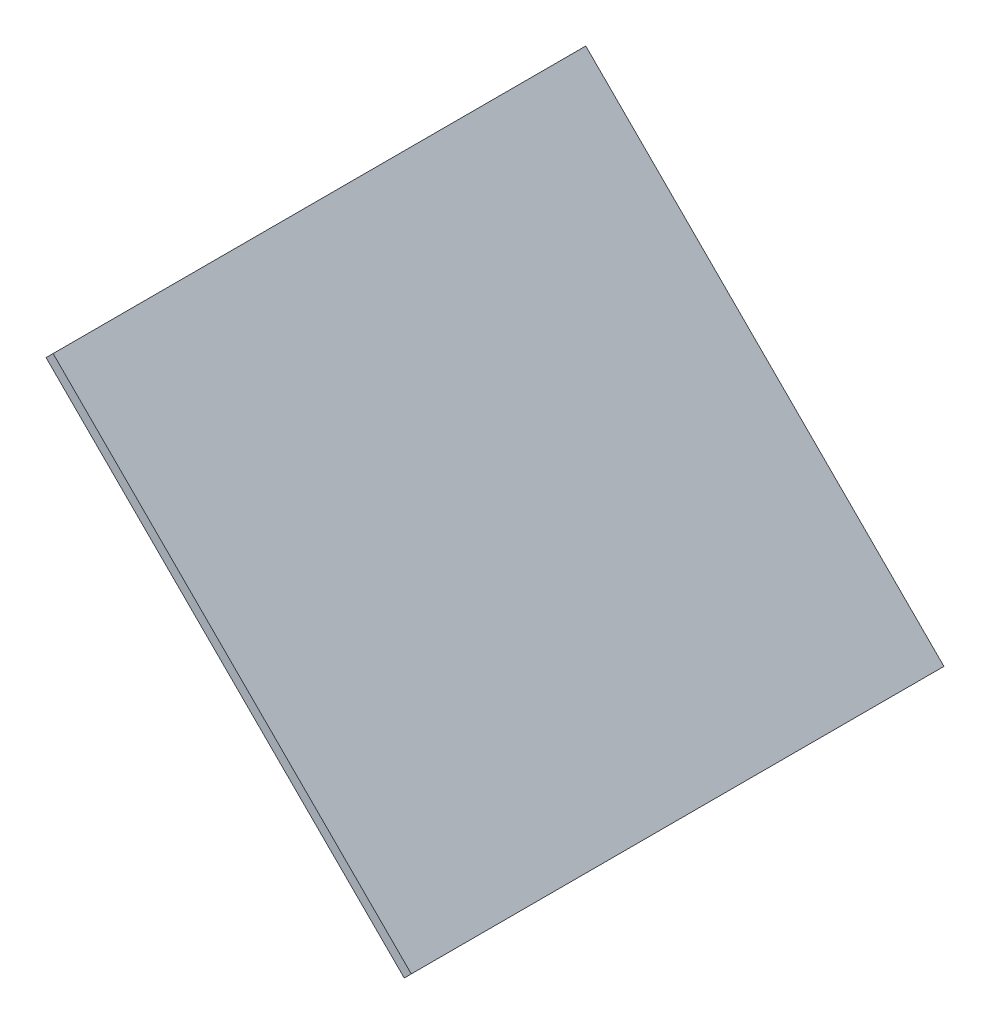
ISO-10303-21;
HEADER;
FILE_DESCRIPTION(('STEP AP214'),'2;1');
FILE_NAME('part.step','',(''),(''),'','','');
FILE_SCHEMA(('AUTOMOTIVE_DESIGN { 1 0 10303 214 1 1 1 1 }'));
ENDSEC;
DATA;
#1=APPLICATION_CONTEXT('core data for automotive mechanical design processes');
#2=APPLICATION_PROTOCOL_DEFINITION('international standard','automotive_design',2000,#1);
#3=PRODUCT_CONTEXT('',#1,'mechanical');
#4=PRODUCT('Part','Part','',(#3));
#5=PRODUCT_RELATED_PRODUCT_CATEGORY('part','',(#4));
#6=PRODUCT_DEFINITION_FORMATION('','',#4);
#7=PRODUCT_DEFINITION_CONTEXT('part definition',#1,'design');
#8=PRODUCT_DEFINITION('design','',#6,#7);
#9=PRODUCT_DEFINITION_SHAPE('','',#8);
#10=(LENGTH_UNIT() NAMED_UNIT(*) SI_UNIT(.MILLI.,.METRE.));
#11=(NAMED_UNIT(*) PLANE_ANGLE_UNIT() SI_UNIT($,.RADIAN.));
#12=(NAMED_UNIT(*) SI_UNIT($,.STERADIAN.) SOLID_ANGLE_UNIT());
#13=UNCERTAINTY_MEASURE_WITH_UNIT(LENGTH_MEASURE(1.E-05),#10,'distance_accuracy_value','');
#14=(GEOMETRIC_REPRESENTATION_CONTEXT(3) GLOBAL_UNCERTAINTY_ASSIGNED_CONTEXT((#13)) GLOBAL_UNIT_ASSIGNED_CONTEXT((#10,
#11,#12)) REPRESENTATION_CONTEXT('',''));
#15=CARTESIAN_POINT('',(0.,0.,0.));
#16=DIRECTION('',(0.,0.,1.));
#17=DIRECTION('',(1.,0.,0.));
#18=AXIS2_PLACEMENT_3D('',#15,#16,#17);
#19=CARTESIAN_POINT('',(13.8913858929721,27.3998696850346,13.3585523374909));
#20=DIRECTION('',(0.,0.,1.));
#21=DIRECTION('',(1.,0.,0.));
#22=AXIS2_PLACEMENT_3D('',#19,#20,#21);
#23=PLANE('',#22);
#24=DIRECTION('',(0.707106781186544,-0.707106781186552,0.));
#25=VECTOR('',#24,1.);
#26=CARTESIAN_POINT('',(14.2450509971877,27.7535347892501,13.3585523374909));
#27=LINE('',#26,#25);
#28=CARTESIAN_POINT('',(14.2450509971877,27.7535347892501,13.3585523374909));
#29=VERTEX_POINT('',#28);
#30=CARTESIAN_POINT('',(32.2106111633918,9.78797462304584,13.3585523374909));
#31=VERTEX_POINT('',#30);
#32=EDGE_CURVE('E80',#29,#31,#27,.T.);
#33=ORIENTED_EDGE('',*,*,#32,.F.);
#34=DIRECTION('',(0.707106781186552,0.707106781186543,0.));
#35=VECTOR('',#34,1.);
#36=CARTESIAN_POINT('',(13.8913858929721,27.3998696850346,13.3585523374909));
#37=LINE('',#36,#35);
#38=CARTESIAN_POINT('',(13.8913858929721,27.3998696850346,13.3585523374909));
#39=VERTEX_POINT('',#38);
#40=EDGE_CURVE('E33',#39,#29,#37,.T.);
#41=ORIENTED_EDGE('',*,*,#40,.F.);
#42=DIRECTION('',(0.707106781186544,-0.707106781186552,0.));
#43=VECTOR('',#42,1.);
#44=CARTESIAN_POINT('',(13.8913858929721,27.3998696850346,13.3585523374909));
#45=LINE('',#44,#43);
#46=CARTESIAN_POINT('',(31.8569460591762,9.43430951883027,13.3585523374909));
#47=VERTEX_POINT('',#46);
#48=EDGE_CURVE('E72',#39,#47,#45,.T.);
#49=ORIENTED_EDGE('',*,*,#48,.T.);
#50=DIRECTION('',(0.707106781186552,0.707106781186543,0.));
#51=VECTOR('',#50,1.);
#52=CARTESIAN_POINT('',(31.8569460591762,9.43430951883027,13.3585523374909));
#53=LINE('',#52,#51);
#54=EDGE_CURVE('E11',#47,#31,#53,.T.);
#55=ORIENTED_EDGE('',*,*,#54,.T.);
#56=EDGE_LOOP('',(#33,#41,#49,#55));
#57=FACE_BOUND('',#56,.T.);
#58=ADVANCED_FACE('F17',(#57),#23,.T.);
#59=CARTESIAN_POINT('',(31.8569460591762,9.43430951883027,13.3585523374909));
#60=DIRECTION('',(0.707106781186543,-0.707106781186552,0.));
#61=DIRECTION('',(0.707106781186552,0.707106781186543,0.));
#62=AXIS2_PLACEMENT_3D('',#59,#60,#61);
#63=PLANE('',#62);
#64=DIRECTION('',(0.,0.,-1.));
#65=VECTOR('',#64,1.);
#66=CARTESIAN_POINT('',(32.2106111633918,9.78797462304584,13.3585523374909));
#67=LINE('',#66,#65);
#68=CARTESIAN_POINT('',(32.2106111633918,9.78797462304584,-13.3585523374909));
#69=VERTEX_POINT('',#68);
#70=EDGE_CURVE('E83',#31,#69,#67,.T.);
#71=ORIENTED_EDGE('',*,*,#70,.F.);
#72=ORIENTED_EDGE('',*,*,#54,.F.);
#73=DIRECTION('',(0.,0.,-1.));
#74=VECTOR('',#73,1.);
#75=CARTESIAN_POINT('',(31.8569460591762,9.43430951883027,13.3585523374909));
#76=LINE('',#75,#74);
#77=CARTESIAN_POINT('',(31.8569460591762,9.43430951883027,-13.3585523374909));
#78=VERTEX_POINT('',#77);
#79=EDGE_CURVE('E68',#47,#78,#76,.T.);
#80=ORIENTED_EDGE('',*,*,#79,.T.);
#81=DIRECTION('',(0.707106781186552,0.707106781186543,0.));
#82=VECTOR('',#81,1.);
#83=CARTESIAN_POINT('',(31.8569460591762,9.43430951883027,-13.3585523374909));
#84=LINE('',#83,#82);
#85=EDGE_CURVE('E25',#78,#69,#84,.T.);
#86=ORIENTED_EDGE('',*,*,#85,.T.);
#87=EDGE_LOOP('',(#71,#72,#80,#86));
#88=FACE_BOUND('',#87,.T.);
#89=ADVANCED_FACE('F69',(#88),#63,.T.);
#90=CARTESIAN_POINT('',(31.8569460591762,9.43430951883027,-13.3585523374909));
#91=DIRECTION('',(0.,0.,-1.));
#92=DIRECTION('',(-1.,0.,0.));
#93=AXIS2_PLACEMENT_3D('',#90,#91,#92);
#94=PLANE('',#93);
#95=DIRECTION('',(-0.707106781186544,0.707106781186552,0.));
#96=VECTOR('',#95,1.);
#97=CARTESIAN_POINT('',(32.2106111633918,9.78797462304584,-13.3585523374909));
#98=LINE('',#97,#96);
#99=CARTESIAN_POINT('',(14.2450509971877,27.7535347892501,-13.3585523374909));
#100=VERTEX_POINT('',#99);
#101=EDGE_CURVE('E66',#69,#100,#98,.T.);
#102=ORIENTED_EDGE('',*,*,#101,.F.);
#103=ORIENTED_EDGE('',*,*,#85,.F.);
#104=DIRECTION('',(-0.707106781186544,0.707106781186552,0.));
#105=VECTOR('',#104,1.);
#106=CARTESIAN_POINT('',(31.8569460591762,9.43430951883027,-13.3585523374909));
#107=LINE('',#106,#105);
#108=CARTESIAN_POINT('',(13.8913858929721,27.3998696850346,-13.3585523374909));
#109=VERTEX_POINT('',#108);
#110=EDGE_CURVE('E63',#78,#109,#107,.T.);
#111=ORIENTED_EDGE('',*,*,#110,.T.);
#112=DIRECTION('',(0.707106781186552,0.707106781186543,0.));
#113=VECTOR('',#112,1.);
#114=CARTESIAN_POINT('',(13.8913858929721,27.3998696850346,-13.3585523374909));
#115=LINE('',#114,#113);
#116=EDGE_CURVE('E49',#109,#100,#115,.T.);
#117=ORIENTED_EDGE('',*,*,#116,.T.);
#118=EDGE_LOOP('',(#102,#103,#111,#117));
#119=FACE_BOUND('',#118,.T.);
#120=ADVANCED_FACE('F61',(#119),#94,.T.);
#121=CARTESIAN_POINT('',(13.8913858929721,27.3998696850346,-13.3585523374909));
#122=DIRECTION('',(-0.707106781186543,0.707106781186552,0.));
#123=DIRECTION('',(-0.707106781186552,-0.707106781186543,0.));
#124=AXIS2_PLACEMENT_3D('',#121,#122,#123);
#125=PLANE('',#124);
#126=DIRECTION('',(0.,0.,1.));
#127=VECTOR('',#126,1.);
#128=CARTESIAN_POINT('',(14.2450509971877,27.7535347892501,-13.3585523374909));
#129=LINE('',#128,#127);
#130=EDGE_CURVE('E86',#100,#29,#129,.T.);
#131=ORIENTED_EDGE('',*,*,#130,.F.);
#132=ORIENTED_EDGE('',*,*,#116,.F.);
#133=DIRECTION('',(0.,0.,1.));
#134=VECTOR('',#133,1.);
#135=CARTESIAN_POINT('',(13.8913858929721,27.3998696850346,-13.3585523374909));
#136=LINE('',#135,#134);
#137=EDGE_CURVE('E75',#109,#39,#136,.T.);
#138=ORIENTED_EDGE('',*,*,#137,.T.);
#139=ORIENTED_EDGE('',*,*,#40,.T.);
#140=EDGE_LOOP('',(#131,#132,#138,#139));
#141=FACE_BOUND('',#140,.T.);
#142=ADVANCED_FACE('F98',(#141),#125,.T.);
#143=CARTESIAN_POINT('',(31.6032720990266,9.68798347897985,0.));
#144=DIRECTION('',(0.707106781186552,0.707106781186544,0.));
#145=DIRECTION('',(-0.707106781186544,0.707106781186552,0.));
#146=AXIS2_PLACEMENT_3D('',#143,#144,#145);
#147=PLANE('',#146);
#148=ORIENTED_EDGE('',*,*,#48,.F.);
#149=ORIENTED_EDGE('',*,*,#137,.F.);
#150=ORIENTED_EDGE('',*,*,#110,.F.);
#151=ORIENTED_EDGE('',*,*,#79,.F.);
#152=EDGE_LOOP('',(#148,#149,#150,#151));
#153=FACE_BOUND('',#152,.T.);
#154=ADVANCED_FACE('F74',(#153),#147,.F.);
#155=CARTESIAN_POINT('',(31.9569372032422,10.0416485831954,0.));
#156=DIRECTION('',(0.707106781186552,0.707106781186544,0.));
#157=DIRECTION('',(-0.707106781186544,0.707106781186552,0.));
#158=AXIS2_PLACEMENT_3D('',#155,#156,#157);
#159=PLANE('',#158);
#160=ORIENTED_EDGE('',*,*,#32,.T.);
#161=ORIENTED_EDGE('',*,*,#70,.T.);
#162=ORIENTED_EDGE('',*,*,#101,.T.);
#163=ORIENTED_EDGE('',*,*,#130,.T.);
#164=EDGE_LOOP('',(#160,#161,#162,#163));
#165=FACE_BOUND('',#164,.T.);
#166=ADVANCED_FACE('F90',(#165),#159,.T.);
#167=CLOSED_SHELL('',(#58,#89,#120,#142,#154,#166));
#168=MANIFOLD_SOLID_BREP('B1',#167);
#169=ADVANCED_BREP_SHAPE_REPRESENTATION('',(#18,#168),#14);
#170=SHAPE_DEFINITION_REPRESENTATION(#9,#169);
ENDSEC;
END-ISO-10303-21;
